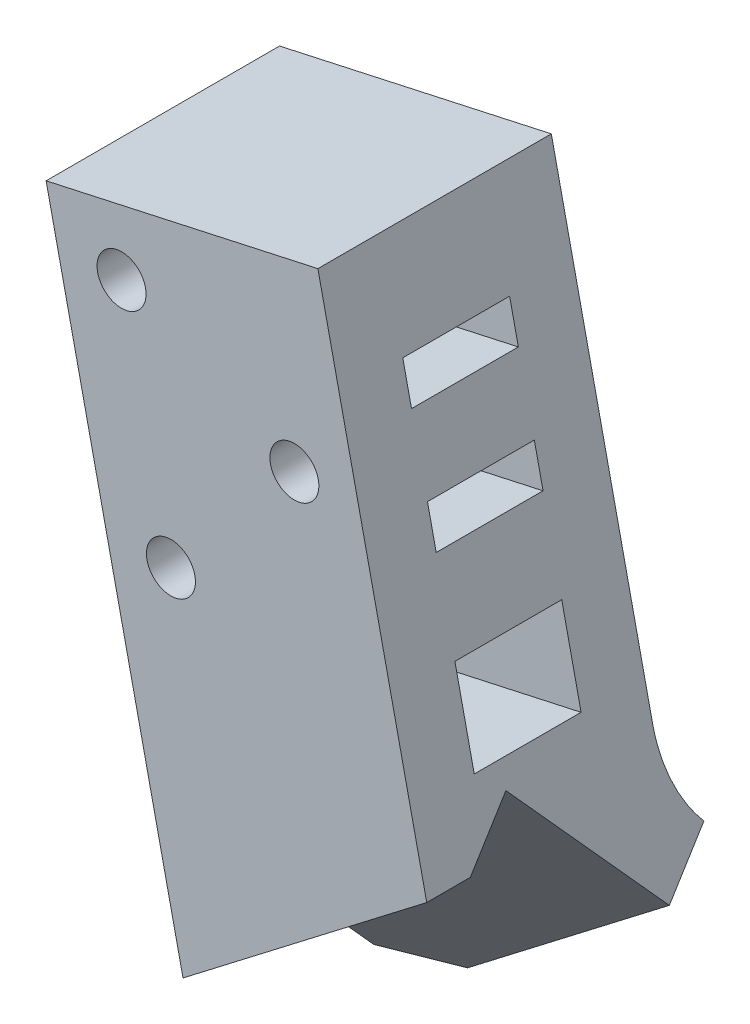
ISO-10303-21;
HEADER;
FILE_DESCRIPTION(('STEP AP214'),'2;1');
FILE_NAME('part.step','',(''),(''),'','','');
FILE_SCHEMA(('AUTOMOTIVE_DESIGN { 1 0 10303 214 1 1 1 1 }'));
ENDSEC;
DATA;
#1=APPLICATION_CONTEXT('core data for automotive mechanical design processes');
#2=APPLICATION_PROTOCOL_DEFINITION('international standard','automotive_design',2000,#1);
#3=PRODUCT_CONTEXT('',#1,'mechanical');
#4=PRODUCT('Part','Part','',(#3));
#5=PRODUCT_RELATED_PRODUCT_CATEGORY('part','',(#4));
#6=PRODUCT_DEFINITION_FORMATION('','',#4);
#7=PRODUCT_DEFINITION_CONTEXT('part definition',#1,'design');
#8=PRODUCT_DEFINITION('design','',#6,#7);
#9=PRODUCT_DEFINITION_SHAPE('','',#8);
#10=(LENGTH_UNIT() NAMED_UNIT(*) SI_UNIT(.MILLI.,.METRE.));
#11=(NAMED_UNIT(*) PLANE_ANGLE_UNIT() SI_UNIT($,.RADIAN.));
#12=(NAMED_UNIT(*) SI_UNIT($,.STERADIAN.) SOLID_ANGLE_UNIT());
#13=UNCERTAINTY_MEASURE_WITH_UNIT(LENGTH_MEASURE(1.E-05),#10,'distance_accuracy_value','');
#14=(GEOMETRIC_REPRESENTATION_CONTEXT(3) GLOBAL_UNCERTAINTY_ASSIGNED_CONTEXT((#13)) GLOBAL_UNIT_ASSIGNED_CONTEXT((#10,
#11,#12)) REPRESENTATION_CONTEXT('',''));
#15=CARTESIAN_POINT('',(0.,0.,0.));
#16=DIRECTION('',(0.,0.,1.));
#17=DIRECTION('',(1.,0.,0.));
#18=AXIS2_PLACEMENT_3D('',#15,#16,#17);
#19=CARTESIAN_POINT('',(0.,0.,-23.4188));
#20=DIRECTION('',(0.,0.,1.));
#21=DIRECTION('',(-1.,0.,0.));
#22=AXIS2_PLACEMENT_3D('',#19,#20,#21);
#23=PLANE('',#22);
#24=CARTESIAN_POINT('',(-439.229521786331,-3141.35853638833,-23.4188));
#25=DIRECTION('',(0.,0.,1.));
#26=DIRECTION('',(1.,0.,0.));
#27=AXIS2_PLACEMENT_3D('',#24,#25,#26);
#28=CIRCLE('',#27,2.45744999999997);
#29=CARTESIAN_POINT('',(-436.772071786331,-3141.35853638833,-23.4188));
#30=VERTEX_POINT('',#29);
#31=EDGE_CURVE('E326',#30,#30,#28,.T.);
#32=ORIENTED_EDGE('',*,*,#31,.T.);
#33=EDGE_LOOP('',(#32));
#34=FACE_BOUND('',#33,.T.);
#35=CARTESIAN_POINT('',(-444.184860767666,-3118.84286161487,-23.4188));
#36=DIRECTION('',(0.,0.,1.));
#37=DIRECTION('',(1.,0.,0.));
#38=AXIS2_PLACEMENT_3D('',#35,#36,#37);
#39=CIRCLE('',#38,2.45744999999997);
#40=CARTESIAN_POINT('',(-441.727410767666,-3118.84286161487,-23.4188));
#41=VERTEX_POINT('',#40);
#42=EDGE_CURVE('E334',#41,#41,#39,.T.);
#43=ORIENTED_EDGE('',*,*,#42,.T.);
#44=EDGE_LOOP('',(#43));
#45=FACE_BOUND('',#44,.T.);
#46=DIRECTION('',(0.214939998904922,-0.976627255850845,0.));
#47=VECTOR('',#46,1.);
#48=CARTESIAN_POINT('',(-451.751312835365,-3114.00614753326,-23.4188));
#49=LINE('',#48,#47);
#50=CARTESIAN_POINT('',(-451.751312835365,-3114.00614753326,-23.4188));
#51=VERTEX_POINT('',#50);
#52=CARTESIAN_POINT('',(-438.776488933921,-3172.96011946298,-23.4188));
#53=VERTEX_POINT('',#52);
#54=EDGE_CURVE('E349',#51,#53,#49,.T.);
#55=ORIENTED_EDGE('',*,*,#54,.F.);
#56=DIRECTION('',(-0.97662725585084,-0.214939998904944,0.));
#57=VECTOR('',#56,1.);
#58=CARTESIAN_POINT('',(-424.487246991543,-3108.00576381726,-23.4188));
#59=LINE('',#58,#57);
#60=CARTESIAN_POINT('',(-424.487246991543,-3108.00576381726,-23.4188));
#61=VERTEX_POINT('',#60);
#62=EDGE_CURVE('E357',#61,#51,#59,.T.);
#63=ORIENTED_EDGE('',*,*,#62,.F.);
#64=DIRECTION('',(-0.214939998904948,0.976627255850839,0.));
#65=VECTOR('',#64,1.);
#66=CARTESIAN_POINT('',(-416.376864854896,-3144.85707250977,-23.4188));
#67=LINE('',#66,#65);
#68=CARTESIAN_POINT('',(-414.325673176529,-3154.17711396447,-23.4188));
#69=VERTEX_POINT('',#68);
#70=EDGE_CURVE('E353',#69,#61,#67,.T.);
#71=ORIENTED_EDGE('',*,*,#70,.F.);
#72=CARTESIAN_POINT('',(-354.890114563021,-3108.518988063,-23.4188));
#73=CARTESIAN_POINT('',(-351.977187853561,-3112.31089635443,-23.4188));
#74=CARTESIAN_POINT('',(-349.787573346993,-3115.16123150894,-26.572351700052));
#75=CARTESIAN_POINT('',(-367.146987632977,-3117.93466222912,-23.4188));
#76=CARTESIAN_POINT('',(-364.23406092023,-3121.72657053228,-23.4188));
#77=CARTESIAN_POINT('',(-362.044446407888,-3124.57690568686,-26.5723517131039));
#78=CARTESIAN_POINT('',(-379.403860702934,-3127.35033639525,-23.4188));
#79=CARTESIAN_POINT('',(-376.490933983304,-3131.14224470736,-23.4188));
#80=CARTESIAN_POINT('',(-374.301319468782,-3133.99257986479,-26.5723517261558));
#81=CARTESIAN_POINT('',(-403.917606842847,-3146.1816847275,-23.4188));
#82=CARTESIAN_POINT('',(-401.004680109452,-3149.97359305753,-23.4188));
#83=CARTESIAN_POINT('',(-398.81506559057,-3152.82392822063,-26.5723517522596));
#84=CARTESIAN_POINT('',(-416.174479912804,-3155.59735889362,-23.4188));
#85=CARTESIAN_POINT('',(-413.261553172526,-3159.38926723261,-23.4188));
#86=CARTESIAN_POINT('',(-411.071938651464,-3162.23960239855,-26.5723517653115));
#87=CARTESIAN_POINT('',(-431.788473522686,-3167.59195779528,-23.4188));
#88=CARTESIAN_POINT('',(-428.875546770315,-3171.38386614313,-23.4188));
#89=CARTESIAN_POINT('',(-426.685932249802,-3174.23420131523,-26.5723517819383));
#90=CARTESIAN_POINT('',(-435.145594062611,-3170.17088253081,-23.4188));
#91=CARTESIAN_POINT('',(-432.232667308355,-3173.96279088111,-23.4188));
#92=CARTESIAN_POINT('',(-430.043052787245,-3176.81312605399,-26.5723517855132));
#93=CARTESIAN_POINT('',(-441.859835142462,-3175.32873200186,-23.4188));
#94=CARTESIAN_POINT('',(-438.946908384436,-3179.12064035707,-23.4188));
#95=CARTESIAN_POINT('',(-436.757293862132,-3181.97097553151,-26.5723517926629));
#96=CARTESIAN_POINT('',(-445.216955682387,-3177.90765673739,-23.4188));
#97=CARTESIAN_POINT('',(-442.304028922476,-3181.69956509506,-23.4188));
#98=CARTESIAN_POINT('',(-440.114414399575,-3184.54990027027,-26.5723517962378));
#99=CARTESIAN_POINT('',(-448.574076222313,-3180.48658147292,-23.4188));
#100=CARTESIAN_POINT('',(-445.661149460247,-3184.27848983283,-23.4188));
#101=CARTESIAN_POINT('',(-443.471534937018,-3187.12882500903,-26.5723517998127));
#102=(BOUNDED_SURFACE() B_SPLINE_SURFACE(3,2,((#72,#73,#74),(#75,#76,#77),(#78,#79,#80),(#81,
#82,#83),(#84,#85,#86),(#87,#88,#89),(#90,#91,#92),(#93,#94,#95),(#96,#97,#98),(#99,#100,#101)),
.UNSPECIFIED.,.F.,.F.,.F.) B_SPLINE_SURFACE_WITH_KNOTS((4,2,2,2,4),(3,3),(0.,46.3677982774786,
92.7355965549573,105.435596554957,118.135596554957),(0.,1.),
.UNSPECIFIED.) GEOMETRIC_REPRESENTATION_ITEM() RATIONAL_B_SPLINE_SURFACE(((1.,0.935865599997023,
1.),(1.,0.935865599722494,1.),(1.,0.935865599447958,1.),(1.,0.935865598898886,1.),(1.,
0.93586559862435,1.),(1.,0.935865598274627,1.),(1.,0.935865598199434,1.),(1.,0.935865598049047,
1.),(1.,0.935865597973853,1.),(1.,0.935865597898657,1.))) REPRESENTATION_ITEM('') SURFACE());
#103=CARTESIAN_POINT('',(-448.574076222313,-3180.48658147292,-23.4188));
#104=CARTESIAN_POINT('',(-445.216955682387,-3177.90765673739,-23.4188));
#105=CARTESIAN_POINT('',(-441.859835142462,-3175.32873200186,-23.4188));
#106=CARTESIAN_POINT('',(-435.145594062611,-3170.17088253081,-23.4188));
#107=CARTESIAN_POINT('',(-431.788473522686,-3167.59195779528,-23.4188));
#108=CARTESIAN_POINT('',(-416.174479912804,-3155.59735889362,-23.4188));
#109=CARTESIAN_POINT('',(-403.917606842847,-3146.1816847275,-23.4188));
#110=CARTESIAN_POINT('',(-379.403860702934,-3127.35033639525,-23.4188));
#111=CARTESIAN_POINT('',(-367.146987632977,-3117.93466222912,-23.4188));
#112=CARTESIAN_POINT('',(-354.890114563021,-3108.518988063,-23.4188));
#113=B_SPLINE_CURVE_WITH_KNOTS('',3,(#103,#104,#105,#106,#107,#108,#109,#110,#111,#112),
.UNSPECIFIED.,.F.,.F.,(4,2,2,2,4),(0.,12.6999999999998,25.3999999999998,71.7677982774785,
118.135596554957),.UNSPECIFIED.);
#114=EDGE_CURVE('E425',#53,#69,#113,.T.);
#115=ORIENTED_EDGE('',*,*,#114,.F.);
#116=EDGE_LOOP('',(#55,#63,#71,#115));
#117=FACE_BOUND('',#116,.T.);
#118=CARTESIAN_POINT('',(-426.846291582482,-3126.83005327169,-23.4188));
#119=DIRECTION('',(0.,0.,1.));
#120=DIRECTION('',(1.,0.,0.));
#121=AXIS2_PLACEMENT_3D('',#118,#119,#120);
#122=CIRCLE('',#121,2.45744999999997);
#123=CARTESIAN_POINT('',(-424.388841582482,-3126.83005327169,-23.4188));
#124=VERTEX_POINT('',#123);
#125=EDGE_CURVE('E342',#124,#124,#122,.T.);
#126=ORIENTED_EDGE('',*,*,#125,.T.);
#127=EDGE_LOOP('',(#126));
#128=FACE_BOUND('',#127,.T.);
#129=ADVANCED_FACE('F38',(#34,#45,#117,#128),#23,.F.);
#130=CARTESIAN_POINT('',(-430.644730128087,-3182.63466231101,-22.0997002457174));
#131=DIRECTION('',(-0.419636600196772,0.546262801685791,-0.724915219366847));
#132=DIRECTION('',(0.,-0.798635508908454,-0.601815024663339));
#133=AXIS2_PLACEMENT_3D('',#130,#131,#132);
#134=PLANE('',#133);
#135=DIRECTION('',(0.793020599570211,0.609194819952782,1.14527663349598E-09));
#136=VECTOR('',#135,1.);
#137=CARTESIAN_POINT('',(-430.644730128087,-3182.63466231101,-22.0997002457174));
#138=LINE('',#137,#136);
#139=CARTESIAN_POINT('',(-431.576719114447,-3183.35061201402,-22.0997002470634));
#140=VERTEX_POINT('',#139);
#141=CARTESIAN_POINT('',(-411.328388685993,-3167.79593662154,-22.099700212096));
#142=VERTEX_POINT('',#141);
#143=EDGE_CURVE('E374',#140,#142,#138,.T.);
#144=ORIENTED_EDGE('',*,*,#143,.T.);
#145=DIRECTION('',(-0.162934904566519,0.74033064827306,0.652198396273319));
#146=VECTOR('',#145,1.);
#147=CARTESIAN_POINT('',(-410.051263001117,-3173.59883863769,-27.2117989809774));
#148=LINE('',#147,#146);
#149=CARTESIAN_POINT('',(-414.606672451436,-3152.90033182924,-8.97733445190123));
#150=VERTEX_POINT('',#149);
#151=EDGE_CURVE('E361',#142,#150,#148,.T.);
#152=ORIENTED_EDGE('',*,*,#151,.T.);
#153=DIRECTION('',(0.793020599570211,0.609194819952782,1.14527663349598E-09));
#154=VECTOR('',#153,1.);
#155=CARTESIAN_POINT('',(-439.057488204153,-3171.68333734898,-8.97733448608995));
#156=LINE('',#155,#154);
#157=CARTESIAN_POINT('',(-439.057488201763,-3171.68333735985,-8.97733448663685));
#158=VERTEX_POINT('',#157);
#159=EDGE_CURVE('E369',#158,#150,#156,.T.);
#160=ORIENTED_EDGE('',*,*,#159,.F.);
#161=DIRECTION('',(-0.162934904586066,0.740330648362001,0.652198396167476));
#162=VECTOR('',#161,1.);
#163=CARTESIAN_POINT('',(-437.492369636639,-3178.79479849843,-15.242215680891));
#164=LINE('',#163,#162);
#165=CARTESIAN_POINT('',(-436.818938160591,-3181.85468282804,-17.9378377744077));
#166=VERTEX_POINT('',#165);
#167=EDGE_CURVE('E365',#166,#158,#164,.T.);
#168=ORIENTED_EDGE('',*,*,#167,.F.);
#169=DIRECTION('',(0.764332976711467,-0.218111452073505,-0.606813394039531));
#170=VECTOR('',#169,1.);
#171=CARTESIAN_POINT('',(-190.519660023187,-3252.13909398843,-213.477877875496));
#172=LINE('',#171,#170);
#173=EDGE_CURVE('E481',#140,#166,#172,.F.);
#174=ORIENTED_EDGE('',*,*,#173,.F.);
#175=EDGE_LOOP('',(#144,#152,#160,#168,#174));
#176=FACE_BOUND('',#175,.T.);
#177=ADVANCED_FACE('F448',(#176),#134,.F.);
#178=CARTESIAN_POINT('',(730.7193165667,-951.215358792446,-1139.78864635279));
#179=DIRECTION('',(-0.441614597168841,0.574872701419269,0.688838097618239));
#180=DIRECTION('',(0.,0.767760111423413,-0.64073739652615));
#181=AXIS2_PLACEMENT_3D('',#178,#179,#180);
#182=PLANE('',#181);
#183=DIRECTION('',(-0.793020599396075,-0.609194820179464,-8.44456975149217E-10));
#184=VECTOR('',#183,1.);
#185=CARTESIAN_POINT('',(-407.202840466047,-3159.26737875756,-26.5723517611912));
#186=LINE('',#185,#184);
#187=CARTESIAN_POINT('',(-412.337314757212,-3163.21165857186,-26.5723517666587));
#188=VERTEX_POINT('',#187);
#189=CARTESIAN_POINT('',(-432.58564519939,-3178.76633398893,-26.5723517882204));
#190=VERTEX_POINT('',#189);
#191=EDGE_CURVE('E370',#188,#190,#186,.T.);
#192=ORIENTED_EDGE('',*,*,#191,.F.);
#193=DIRECTION('',(0.155610020400141,-0.707048422725091,0.689831899431324));
#194=VECTOR('',#193,1.);
#195=CARTESIAN_POINT('',(-747.529007650292,-1640.1943287903,-1512.50443747786));
#196=LINE('',#195,#194);
#197=EDGE_CURVE('E422',#188,#142,#196,.T.);
#198=ORIENTED_EDGE('',*,*,#197,.T.);
#199=ORIENTED_EDGE('',*,*,#143,.F.);
#200=DIRECTION('',(0.155610020400117,-0.707048422725102,0.689831899431318));
#201=VECTOR('',#200,1.);
#202=CARTESIAN_POINT('',(-768.99842011186,-1650.20074884967,-1517.91759365708));
#203=LINE('',#202,#201);
#204=EDGE_CURVE('E476',#190,#140,#203,.T.);
#205=ORIENTED_EDGE('',*,*,#204,.F.);
#206=EDGE_LOOP('',(#192,#198,#199,#205));
#207=FACE_BOUND('',#206,.T.);
#208=ADVANCED_FACE('F452',(#207),#182,.F.);
#209=CARTESIAN_POINT('',(1369.31075164133,-1782.50307535105,-8.97733187412508));
#210=DIRECTION('',(0.44161459716884,-0.574872701419272,-0.68883809761824));
#211=DIRECTION('',(-0.793020599570292,-0.609194819952675,-1.14542382249495E-09));
#212=AXIS2_PLACEMENT_3D('',#209,#210,#211);
#213=PLANE('',#212);
#214=DIRECTION('',(-0.155610020400119,0.7070484227251,-0.68983189943132));
#215=VECTOR('',#214,1.);
#216=CARTESIAN_POINT('',(-419.136446570394,-3132.31830479862,-29.0581922017404));
#217=LINE('',#216,#215);
#218=CARTESIAN_POINT('',(-413.56829504717,-3157.61842841449,-4.37412281012715));
#219=VERTEX_POINT('',#218);
#220=EDGE_CURVE('E382',#219,#150,#217,.T.);
#221=ORIENTED_EDGE('',*,*,#220,.F.);
#222=DIRECTION('',(0.7930205995703,0.609194819952667,1.14542632705883E-09));
#223=VECTOR('',#222,1.);
#224=CARTESIAN_POINT('',(-438.019110846727,-3176.40143397169,-4.37412284544345));
#225=LINE('',#224,#223);
#226=CARTESIAN_POINT('',(-438.01911079961,-3176.4014339355,-4.37412284544343));
#227=VERTEX_POINT('',#226);
#228=EDGE_CURVE('E386',#227,#219,#225,.T.);
#229=ORIENTED_EDGE('',*,*,#228,.F.);
#230=DIRECTION('',(0.155610020400119,-0.7070484227251,0.68983189943132));
#231=VECTOR('',#230,1.);
#232=CARTESIAN_POINT('',(-444.660319490351,-3146.22563858695,-33.8151420926236));
#233=LINE('',#232,#231);
#234=EDGE_CURVE('E378',#158,#227,#233,.T.);
#235=ORIENTED_EDGE('',*,*,#234,.F.);
#236=ORIENTED_EDGE('',*,*,#159,.T.);
#237=EDGE_LOOP('',(#221,#229,#235,#236));
#238=FACE_BOUND('',#237,.T.);
#239=ADVANCED_FACE('F518',(#238),#213,.T.);
#240=CARTESIAN_POINT('',(-424.487246991543,-3108.00576381726,-4.3688));
#241=DIRECTION('',(0.214939998904944,-0.97662725585084,0.));
#242=DIRECTION('',(0.97662725585084,0.214939998904944,0.));
#243=AXIS2_PLACEMENT_3D('',#240,#241,#242);
#244=PLANE('',#243);
#245=DIRECTION('',(-0.97662725585084,-0.214939998904944,0.));
#246=VECTOR('',#245,1.);
#247=CARTESIAN_POINT('',(-424.487246991543,-3108.00576381726,0.));
#248=LINE('',#247,#246);
#249=CARTESIAN_POINT('',(-424.487246991543,-3108.00576381726,0.));
#250=VERTEX_POINT('',#249);
#251=CARTESIAN_POINT('',(-451.751312835365,-3114.00614753326,0.));
#252=VERTEX_POINT('',#251);
#253=EDGE_CURVE('E385',#250,#252,#248,.T.);
#254=ORIENTED_EDGE('',*,*,#253,.F.);
#255=DIRECTION('',(0.,0.,1.));
#256=VECTOR('',#255,1.);
#257=CARTESIAN_POINT('',(-424.487246991543,-3108.00576381726,-4.3688));
#258=LINE('',#257,#256);
#259=EDGE_CURVE('E406',#61,#250,#258,.T.);
#260=ORIENTED_EDGE('',*,*,#259,.F.);
#261=ORIENTED_EDGE('',*,*,#62,.T.);
#262=DIRECTION('',(0.,0.,1.));
#263=VECTOR('',#262,1.);
#264=CARTESIAN_POINT('',(-451.751312835365,-3114.00614753326,-4.3688));
#265=LINE('',#264,#263);
#266=EDGE_CURVE('E418',#51,#252,#265,.T.);
#267=ORIENTED_EDGE('',*,*,#266,.T.);
#268=EDGE_LOOP('',(#254,#260,#261,#267));
#269=FACE_BOUND('',#268,.T.);
#270=ADVANCED_FACE('F515',(#269),#244,.F.);
#271=CARTESIAN_POINT('',(-451.751312835365,-3114.00614753326,-4.3688));
#272=DIRECTION('',(0.976627255850845,0.214939998904922,0.));
#273=DIRECTION('',(-0.214939998904922,0.976627255850845,0.));
#274=AXIS2_PLACEMENT_3D('',#271,#272,#273);
#275=PLANE('',#274);
#276=DIRECTION('',(0.,0.,-1.));
#277=VECTOR('',#276,1.);
#278=CARTESIAN_POINT('',(-447.107596252733,-3135.10589725947,-4.3688));
#279=LINE('',#278,#277);
#280=CARTESIAN_POINT('',(-447.107596252733,-3135.10589725947,-6.35000000000001));
#281=VERTEX_POINT('',#280);
#282=CARTESIAN_POINT('',(-447.107596252733,-3135.10589725947,-17.0688));
#283=VERTEX_POINT('',#282);
#284=EDGE_CURVE('E318',#281,#283,#279,.T.);
#285=ORIENTED_EDGE('',*,*,#284,.F.);
#286=DIRECTION('',(-0.214939998904922,0.976627255850845,0.));
#287=VECTOR('',#286,1.);
#288=CARTESIAN_POINT('',(-451.751312835365,-3114.00614753326,-6.35000000000002));
#289=LINE('',#288,#287);
#290=CARTESIAN_POINT('',(-446.232282959902,-3139.08307611655,-6.35000000000001));
#291=VERTEX_POINT('',#290);
#292=EDGE_CURVE('E315',#291,#281,#289,.T.);
#293=ORIENTED_EDGE('',*,*,#292,.F.);
#294=DIRECTION('',(0.,0.,1.));
#295=VECTOR('',#294,1.);
#296=CARTESIAN_POINT('',(-446.232282959902,-3139.08307611655,-4.3688));
#297=LINE('',#296,#295);
#298=CARTESIAN_POINT('',(-446.232282959902,-3139.08307611655,-17.0688));
#299=VERTEX_POINT('',#298);
#300=EDGE_CURVE('E312',#299,#291,#297,.T.);
#301=ORIENTED_EDGE('',*,*,#300,.F.);
#302=DIRECTION('',(0.214939998904922,-0.976627255850845,0.));
#303=VECTOR('',#302,1.);
#304=CARTESIAN_POINT('',(-451.751312835365,-3114.00614753326,-17.0688));
#305=LINE('',#304,#303);
#306=EDGE_CURVE('E322',#283,#299,#305,.T.);
#307=ORIENTED_EDGE('',*,*,#306,.F.);
#308=EDGE_LOOP('',(#285,#293,#301,#307));
#309=FACE_BOUND('',#308,.T.);
#310=DIRECTION('',(0.,0.,-1.));
#311=VECTOR('',#310,1.);
#312=CARTESIAN_POINT('',(-444.356952963456,-3147.60405126113,-4.3688));
#313=LINE('',#312,#311);
#314=CARTESIAN_POINT('',(-444.356952963456,-3147.60405126113,-6.35));
#315=VERTEX_POINT('',#314);
#316=CARTESIAN_POINT('',(-444.356952963456,-3147.60405126113,-17.0688));
#317=VERTEX_POINT('',#316);
#318=EDGE_CURVE('E304',#315,#317,#313,.T.);
#319=ORIENTED_EDGE('',*,*,#318,.F.);
#320=DIRECTION('',(-0.214939998904922,0.976627255850845,0.));
#321=VECTOR('',#320,1.);
#322=CARTESIAN_POINT('',(-451.751312835365,-3114.00614753326,-6.35));
#323=LINE('',#322,#321);
#324=CARTESIAN_POINT('',(-442.416685892478,-3156.42008231538,-6.35));
#325=VERTEX_POINT('',#324);
#326=EDGE_CURVE('E301',#325,#315,#323,.T.);
#327=ORIENTED_EDGE('',*,*,#326,.F.);
#328=DIRECTION('',(0.,0.,1.));
#329=VECTOR('',#328,1.);
#330=CARTESIAN_POINT('',(-442.416685892478,-3156.42008231538,-4.3688));
#331=LINE('',#330,#329);
#332=CARTESIAN_POINT('',(-442.416685892478,-3156.42008231538,-17.0688));
#333=VERTEX_POINT('',#332);
#334=EDGE_CURVE('E192',#333,#325,#331,.T.);
#335=ORIENTED_EDGE('',*,*,#334,.F.);
#336=DIRECTION('',(0.214939998904922,-0.976627255850845,0.));
#337=VECTOR('',#336,1.);
#338=CARTESIAN_POINT('',(-451.751312835365,-3114.00614753326,-17.0688));
#339=LINE('',#338,#337);
#340=EDGE_CURVE('E308',#317,#333,#339,.T.);
#341=ORIENTED_EDGE('',*,*,#340,.F.);
#342=EDGE_LOOP('',(#319,#327,#335,#341));
#343=FACE_BOUND('',#342,.T.);
#344=DIRECTION('',(0.,0.,-1.));
#345=VECTOR('',#344,1.);
#346=CARTESIAN_POINT('',(-449.5852657434,-3123.84805987274,-4.3688));
#347=LINE('',#346,#345);
#348=CARTESIAN_POINT('',(-449.5852657434,-3123.84805987274,-6.35));
#349=VERTEX_POINT('',#348);
#350=CARTESIAN_POINT('',(-449.5852657434,-3123.84805987274,-17.0688));
#351=VERTEX_POINT('',#350);
#352=EDGE_CURVE('E291',#349,#351,#347,.T.);
#353=ORIENTED_EDGE('',*,*,#352,.F.);
#354=DIRECTION('',(-0.214939998904922,0.976627255850845,0.));
#355=VECTOR('',#354,1.);
#356=CARTESIAN_POINT('',(-451.751312835365,-3114.00614753326,-6.35));
#357=LINE('',#356,#355);
#358=CARTESIAN_POINT('',(-448.709952450569,-3127.82523872982,-6.35));
#359=VERTEX_POINT('',#358);
#360=EDGE_CURVE('E287',#359,#349,#357,.T.);
#361=ORIENTED_EDGE('',*,*,#360,.F.);
#362=DIRECTION('',(0.,0.,1.));
#363=VECTOR('',#362,1.);
#364=CARTESIAN_POINT('',(-448.709952450569,-3127.82523872982,-4.3688));
#365=LINE('',#364,#363);
#366=CARTESIAN_POINT('',(-448.709952450569,-3127.82523872982,-17.0688));
#367=VERTEX_POINT('',#366);
#368=EDGE_CURVE('E275',#367,#359,#365,.T.);
#369=ORIENTED_EDGE('',*,*,#368,.F.);
#370=DIRECTION('',(0.214939998904922,-0.976627255850845,0.));
#371=VECTOR('',#370,1.);
#372=CARTESIAN_POINT('',(-451.751312835365,-3114.00614753326,-17.0688));
#373=LINE('',#372,#371);
#374=EDGE_CURVE('E295',#351,#367,#373,.T.);
#375=ORIENTED_EDGE('',*,*,#374,.F.);
#376=EDGE_LOOP('',(#353,#361,#369,#375));
#377=FACE_BOUND('',#376,.T.);
#378=ORIENTED_EDGE('',*,*,#167,.T.);
#379=ORIENTED_EDGE('',*,*,#234,.T.);
#380=DIRECTION('',(0.,0.,1.));
#381=VECTOR('',#380,1.);
#382=CARTESIAN_POINT('',(-438.01911079961,-3176.4014339355,-4.3688));
#383=LINE('',#382,#381);
#384=CARTESIAN_POINT('',(-438.01911079961,-3176.4014339355,0.));
#385=VERTEX_POINT('',#384);
#386=EDGE_CURVE('E414',#227,#385,#383,.T.);
#387=ORIENTED_EDGE('',*,*,#386,.T.);
#388=DIRECTION('',(0.214939998904922,-0.976627255850845,0.));
#389=VECTOR('',#388,1.);
#390=CARTESIAN_POINT('',(-451.751312835365,-3114.00614753326,0.));
#391=LINE('',#390,#389);
#392=EDGE_CURVE('E396',#252,#385,#391,.T.);
#393=ORIENTED_EDGE('',*,*,#392,.F.);
#394=ORIENTED_EDGE('',*,*,#266,.F.);
#395=ORIENTED_EDGE('',*,*,#54,.T.);
#396=CARTESIAN_POINT('',(-436.788130528504,-3181.99466409415,-26.5723518129883));
#397=CARTESIAN_POINT('',(-436.851992492298,-3181.70449318706,-26.3362950790677));
#398=CARTESIAN_POINT('',(-436.917955252799,-3181.40477684713,-26.1126519238735));
#399=CARTESIAN_POINT('',(-437.053530397323,-3180.78876129845,-25.6910103709923));
#400=CARTESIAN_POINT('',(-437.123141371969,-3180.47246849352,-25.4930021711243));
#401=CARTESIAN_POINT('',(-437.265535271106,-3179.82547043046,-25.1232023006508));
#402=CARTESIAN_POINT('',(-437.338319279294,-3179.49476024833,-24.9514196785688));
#403=CARTESIAN_POINT('',(-437.486537499579,-3178.82129809851,-24.6346528318304));
#404=CARTESIAN_POINT('',(-437.561971956087,-3178.4785450203,-24.489671086379));
#405=CARTESIAN_POINT('',(-437.719576337211,-3177.76243478009,-24.2190529016891));
#406=CARTESIAN_POINT('',(-437.801879261574,-3177.38847330442,-24.0950921670295));
#407=CARTESIAN_POINT('',(-437.96835671157,-3176.63204632024,-23.8780480903371));
#408=CARTESIAN_POINT('',(-438.052531538042,-3176.2495794448,-23.7849697503389));
#409=CARTESIAN_POINT('',(-438.22203848367,-3175.47938727955,-23.6300762332093));
#410=CARTESIAN_POINT('',(-438.307368274334,-3175.09167256975,-23.5682056640715));
#411=CARTESIAN_POINT('',(-438.478771037156,-3174.31286634126,-23.4756387855477));
#412=CARTESIAN_POINT('',(-438.564843568979,-3173.92177682331,-23.444925134609));
#413=CARTESIAN_POINT('',(-438.671926351799,-3173.4352225995,-23.426133971586));
#414=CARTESIAN_POINT('',(-438.692843834225,-3173.34017940807,-23.4233825837996));
#415=CARTESIAN_POINT('',(-438.734669983887,-3173.15013307898,-23.4197165362034));
#416=CARTESIAN_POINT('',(-438.755578645352,-3173.05512996753,-23.4188004515642));
#417=CARTESIAN_POINT('',(-438.776488933921,-3172.96011946298,-23.4188));
#418=B_SPLINE_CURVE_WITH_KNOTS('',3,(#396,#397,#398,#399,#400,#401,#402,#403,#404,#405,#406,
#407,#408,#409,#410,#411,#412,#413,#414,#415,#416,#417),.UNSPECIFIED.,.F.,.F.,(4,2,2,2,2,2,2,2,
2,2,4),(0.,1.1379936305767,2.27555082682437,3.41349962790141,4.5515536418928,5.75767553131466,
6.96399268155308,8.16816108633693,9.37165889764143,9.66371918432326,9.95555264329704),.UNSPECIFIED.);
#419=CARTESIAN_POINT('',(-438.123350341156,-3175.92779860503,-23.7204032534594));
#420=VERTEX_POINT('',#419);
#421=EDGE_CURVE('E435',#420,#53,#418,.T.);
#422=ORIENTED_EDGE('',*,*,#421,.F.);
#423=DIRECTION('',(-0.155610020400117,0.707048422725102,-0.689831899431318));
#424=VECTOR('',#423,1.);
#425=CARTESIAN_POINT('',(-443.188907776603,-3152.91132199416,-46.1764321029357));
#426=LINE('',#425,#424);
#427=EDGE_CURVE('E53',#166,#420,#426,.T.);
#428=ORIENTED_EDGE('',*,*,#427,.F.);
#429=EDGE_LOOP('',(#378,#379,#387,#393,#394,#395,#422,#428));
#430=FACE_BOUND('',#429,.T.);
#431=ADVANCED_FACE('F493',(#309,#343,#377,#430),#275,.F.);
#432=CARTESIAN_POINT('',(-413.56829504717,-3157.61842841449,-4.3688));
#433=DIRECTION('',(-0.609194819952676,0.793020599570293,0.));
#434=DIRECTION('',(-0.793020599570293,-0.609194819952676,0.));
#435=AXIS2_PLACEMENT_3D('',#432,#433,#434);
#436=PLANE('',#435);
#437=DIRECTION('',(0.793020599570293,0.609194819952676,0.));
#438=VECTOR('',#437,1.);
#439=CARTESIAN_POINT('',(-413.56829504717,-3157.61842841449,0.));
#440=LINE('',#439,#438);
#441=CARTESIAN_POINT('',(-413.56829504717,-3157.61842841449,0.));
#442=VERTEX_POINT('',#441);
#443=EDGE_CURVE('E400',#385,#442,#440,.T.);
#444=ORIENTED_EDGE('',*,*,#443,.F.);
#445=ORIENTED_EDGE('',*,*,#386,.F.);
#446=ORIENTED_EDGE('',*,*,#228,.T.);
#447=DIRECTION('',(0.,0.,1.));
#448=VECTOR('',#447,1.);
#449=CARTESIAN_POINT('',(-413.56829504717,-3157.61842841449,-4.3688));
#450=LINE('',#449,#448);
#451=EDGE_CURVE('E410',#219,#442,#450,.T.);
#452=ORIENTED_EDGE('',*,*,#451,.T.);
#453=EDGE_LOOP('',(#444,#445,#446,#452));
#454=FACE_BOUND('',#453,.T.);
#455=ADVANCED_FACE('F508',(#454),#436,.F.);
#456=CARTESIAN_POINT('',(-413.56829504717,-3157.61842841449,-4.3688));
#457=DIRECTION('',(-0.976627255850839,-0.21493999890495,0.));
#458=DIRECTION('',(0.21493999890495,-0.976627255850839,0.));
#459=AXIS2_PLACEMENT_3D('',#456,#457,#458);
#460=PLANE('',#459);
#461=DIRECTION('',(0.,0.,1.));
#462=VECTOR('',#461,1.);
#463=CARTESIAN_POINT('',(-418.96821711608,-3133.08269240055,-17.0688));
#464=LINE('',#463,#462);
#465=CARTESIAN_POINT('',(-418.96821711608,-3133.08269240055,-17.0688));
#466=VERTEX_POINT('',#465);
#467=CARTESIAN_POINT('',(-418.96821711608,-3133.08269240055,-6.35000000000001));
#468=VERTEX_POINT('',#467);
#469=EDGE_CURVE('E232',#466,#468,#464,.T.);
#470=ORIENTED_EDGE('',*,*,#469,.T.);
#471=DIRECTION('',(-0.214939998904933,0.976627255850843,0.));
#472=VECTOR('',#471,1.);
#473=CARTESIAN_POINT('',(-418.96821711608,-3133.08269240055,-6.35000000000001));
#474=LINE('',#473,#472);
#475=CARTESIAN_POINT('',(-419.843530408911,-3129.10551354346,-6.35000000000001));
#476=VERTEX_POINT('',#475);
#477=EDGE_CURVE('E236',#468,#476,#474,.T.);
#478=ORIENTED_EDGE('',*,*,#477,.T.);
#479=DIRECTION('',(0.,0.,-1.));
#480=VECTOR('',#479,1.);
#481=CARTESIAN_POINT('',(-419.843530408911,-3129.10551354346,-17.0688));
#482=LINE('',#481,#480);
#483=CARTESIAN_POINT('',(-419.843530408911,-3129.10551354346,-17.0688));
#484=VERTEX_POINT('',#483);
#485=EDGE_CURVE('E240',#476,#484,#482,.T.);
#486=ORIENTED_EDGE('',*,*,#485,.T.);
#487=DIRECTION('',(0.214939998904933,-0.976627255850843,0.));
#488=VECTOR('',#487,1.);
#489=CARTESIAN_POINT('',(-418.96821711608,-3133.08269240055,-17.0688));
#490=LINE('',#489,#488);
#491=EDGE_CURVE('E224',#484,#466,#490,.T.);
#492=ORIENTED_EDGE('',*,*,#491,.T.);
#493=EDGE_LOOP('',(#470,#478,#486,#492));
#494=FACE_BOUND('',#493,.T.);
#495=DIRECTION('',(0.,0.,1.));
#496=VECTOR('',#495,1.);
#497=CARTESIAN_POINT('',(-415.152620048655,-3150.41969859938,-17.0688));
#498=LINE('',#497,#496);
#499=CARTESIAN_POINT('',(-415.152620048655,-3150.41969859938,-17.0688));
#500=VERTEX_POINT('',#499);
#501=CARTESIAN_POINT('',(-415.152620048655,-3150.41969859938,-6.35));
#502=VERTEX_POINT('',#501);
#503=EDGE_CURVE('E190',#500,#502,#498,.T.);
#504=ORIENTED_EDGE('',*,*,#503,.T.);
#505=DIRECTION('',(-0.214939998904948,0.976627255850839,0.));
#506=VECTOR('',#505,1.);
#507=CARTESIAN_POINT('',(-415.152620048655,-3150.41969859938,-6.35));
#508=LINE('',#507,#506);
#509=CARTESIAN_POINT('',(-417.092887119634,-3141.60366754512,-6.35));
#510=VERTEX_POINT('',#509);
#511=EDGE_CURVE('E199',#502,#510,#508,.T.);
#512=ORIENTED_EDGE('',*,*,#511,.T.);
#513=DIRECTION('',(0.,0.,-1.));
#514=VECTOR('',#513,1.);
#515=CARTESIAN_POINT('',(-417.092887119634,-3141.60366754512,-17.0688));
#516=LINE('',#515,#514);
#517=CARTESIAN_POINT('',(-417.092887119634,-3141.60366754512,-17.0688));
#518=VERTEX_POINT('',#517);
#519=EDGE_CURVE('E205',#510,#518,#516,.T.);
#520=ORIENTED_EDGE('',*,*,#519,.T.);
#521=DIRECTION('',(0.214939998904948,-0.976627255850839,0.));
#522=VECTOR('',#521,1.);
#523=CARTESIAN_POINT('',(-415.152620048655,-3150.41969859938,-17.0688));
#524=LINE('',#523,#522);
#525=EDGE_CURVE('E211',#518,#500,#524,.T.);
#526=ORIENTED_EDGE('',*,*,#525,.T.);
#527=EDGE_LOOP('',(#504,#512,#520,#526));
#528=FACE_BOUND('',#527,.T.);
#529=DIRECTION('',(0.,0.,1.));
#530=VECTOR('',#529,1.);
#531=CARTESIAN_POINT('',(-421.445886606748,-3121.82485501382,-17.0688));
#532=LINE('',#531,#530);
#533=CARTESIAN_POINT('',(-421.445886606747,-3121.82485501382,-17.0688));
#534=VERTEX_POINT('',#533);
#535=CARTESIAN_POINT('',(-421.445886606748,-3121.82485501382,-6.35));
#536=VERTEX_POINT('',#535);
#537=EDGE_CURVE('E259',#534,#536,#532,.T.);
#538=ORIENTED_EDGE('',*,*,#537,.T.);
#539=DIRECTION('',(-0.214939998904959,0.976627255850837,0.));
#540=VECTOR('',#539,1.);
#541=CARTESIAN_POINT('',(-421.445886606748,-3121.82485501382,-6.35));
#542=LINE('',#541,#540);
#543=CARTESIAN_POINT('',(-422.321199899578,-3117.84767615673,-6.35));
#544=VERTEX_POINT('',#543);
#545=EDGE_CURVE('E263',#536,#544,#542,.T.);
#546=ORIENTED_EDGE('',*,*,#545,.T.);
#547=DIRECTION('',(0.,0.,-1.));
#548=VECTOR('',#547,1.);
#549=CARTESIAN_POINT('',(-422.321199899578,-3117.84767615673,-17.0688));
#550=LINE('',#549,#548);
#551=CARTESIAN_POINT('',(-422.321199899578,-3117.84767615673,-17.0688));
#552=VERTEX_POINT('',#551);
#553=EDGE_CURVE('E267',#544,#552,#550,.T.);
#554=ORIENTED_EDGE('',*,*,#553,.T.);
#555=DIRECTION('',(0.214939998904959,-0.976627255850837,0.));
#556=VECTOR('',#555,1.);
#557=CARTESIAN_POINT('',(-421.445886606748,-3121.82485501382,-17.0688));
#558=LINE('',#557,#556);
#559=EDGE_CURVE('E248',#552,#534,#558,.T.);
#560=ORIENTED_EDGE('',*,*,#559,.T.);
#561=EDGE_LOOP('',(#538,#546,#554,#560));
#562=FACE_BOUND('',#561,.T.);
#563=ORIENTED_EDGE('',*,*,#70,.T.);
#564=ORIENTED_EDGE('',*,*,#259,.T.);
#565=DIRECTION('',(-0.21493999890495,0.976627255850839,0.));
#566=VECTOR('',#565,1.);
#567=CARTESIAN_POINT('',(-413.56829504717,-3157.61842841449,0.));
#568=LINE('',#567,#566);
#569=EDGE_CURVE('E403',#442,#250,#568,.T.);
#570=ORIENTED_EDGE('',*,*,#569,.F.);
#571=ORIENTED_EDGE('',*,*,#451,.F.);
#572=ORIENTED_EDGE('',*,*,#220,.T.);
#573=ORIENTED_EDGE('',*,*,#151,.F.);
#574=ORIENTED_EDGE('',*,*,#197,.F.);
#575=CARTESIAN_POINT('',(-414.325673176529,-3154.17711396447,-23.4188));
#576=CARTESIAN_POINT('',(-414.243345869296,-3154.55118622908,-23.4187900429517));
#577=CARTESIAN_POINT('',(-414.161016945508,-3154.92526583886,-23.4330050444125));
#578=CARTESIAN_POINT('',(-413.996783730586,-3155.67149564637,-23.4898247725242));
#579=CARTESIAN_POINT('',(-413.914879600854,-3156.04364511073,-23.5324395923215));
#580=CARTESIAN_POINT('',(-413.753995211553,-3156.77465879098,-23.6445959422224));
#581=CARTESIAN_POINT('',(-413.674992706799,-3157.13362408276,-23.7134462410312));
#582=CARTESIAN_POINT('',(-413.518315956836,-3157.84551942636,-23.8779212823007));
#583=CARTESIAN_POINT('',(-413.440641268725,-3158.19845149058,-23.973536904528));
#584=CARTESIAN_POINT('',(-413.2724037,-3158.96287596212,-24.2121038503544));
#585=CARTESIAN_POINT('',(-413.182200838109,-3159.37273254501,-24.36060034373));
#586=CARTESIAN_POINT('',(-413.005031607907,-3160.17773998893,-24.6947638737652));
#587=CARTESIAN_POINT('',(-412.918065347353,-3160.57289036033,-24.8804321466803));
#588=CARTESIAN_POINT('',(-412.745610971816,-3161.35647482296,-25.2943726704896));
#589=CARTESIAN_POINT('',(-412.660245688878,-3161.74435079973,-25.523756963193));
#590=CARTESIAN_POINT('',(-412.494668818301,-3162.49668580283,-26.0201462351888));
#591=CARTESIAN_POINT('',(-412.414459992966,-3162.86113227804,-26.2871711379492));
#592=CARTESIAN_POINT('',(-412.337314775096,-3163.21165857754,-26.5723517610553));
#593=B_SPLINE_CURVE_WITH_KNOTS('',3,(#575,#576,#577,#578,#579,#580,#581,#582,#583,#584,#585,
#586,#587,#588,#589,#590,#591,#592),.UNSPECIFIED.,.F.,.F.,(4,2,2,2,2,2,2,2,4),(0.,
1.14882360941487,2.29805572259678,3.41889615481322,4.53935512670875,5.87301886770368,
7.20672697092492,8.58048972786714,9.95498237774388),.UNSPECIFIED.);
#594=EDGE_CURVE('E482',#69,#188,#593,.T.);
#595=ORIENTED_EDGE('',*,*,#594,.F.);
#596=EDGE_LOOP('',(#563,#564,#570,#571,#572,#573,#574,#595));
#597=FACE_BOUND('',#596,.T.);
#598=ADVANCED_FACE('F208',(#494,#528,#562,#597),#460,.F.);
#599=CARTESIAN_POINT('',(0.,0.,0.));
#600=DIRECTION('',(0.,0.,-1.));
#601=DIRECTION('',(1.,0.,0.));
#602=AXIS2_PLACEMENT_3D('',#599,#600,#601);
#603=PLANE('',#602);
#604=CARTESIAN_POINT('',(-439.229521786331,-3141.35853638833,0.));
#605=DIRECTION('',(0.,0.,1.));
#606=DIRECTION('',(1.,0.,0.));
#607=AXIS2_PLACEMENT_3D('',#604,#605,#606);
#608=CIRCLE('',#607,2.45744999999997);
#609=CARTESIAN_POINT('',(-436.772071786331,-3141.35853638833,0.));
#610=VERTEX_POINT('',#609);
#611=EDGE_CURVE('E330',#610,#610,#608,.T.);
#612=ORIENTED_EDGE('',*,*,#611,.F.);
#613=EDGE_LOOP('',(#612));
#614=FACE_BOUND('',#613,.T.);
#615=CARTESIAN_POINT('',(-444.184860767666,-3118.84286161487,0.));
#616=DIRECTION('',(0.,0.,1.));
#617=DIRECTION('',(1.,0.,0.));
#618=AXIS2_PLACEMENT_3D('',#615,#616,#617);
#619=CIRCLE('',#618,2.45744999999997);
#620=CARTESIAN_POINT('',(-441.727410767666,-3118.84286161487,0.));
#621=VERTEX_POINT('',#620);
#622=EDGE_CURVE('E338',#621,#621,#619,.T.);
#623=ORIENTED_EDGE('',*,*,#622,.F.);
#624=EDGE_LOOP('',(#623));
#625=FACE_BOUND('',#624,.T.);
#626=CARTESIAN_POINT('',(-426.846291582482,-3126.83005327169,0.));
#627=DIRECTION('',(0.,0.,1.));
#628=DIRECTION('',(1.,0.,0.));
#629=AXIS2_PLACEMENT_3D('',#626,#627,#628);
#630=CIRCLE('',#629,2.45744999999997);
#631=CARTESIAN_POINT('',(-424.388841582482,-3126.83005327169,0.));
#632=VERTEX_POINT('',#631);
#633=EDGE_CURVE('E346',#632,#632,#630,.T.);
#634=ORIENTED_EDGE('',*,*,#633,.F.);
#635=EDGE_LOOP('',(#634));
#636=FACE_BOUND('',#635,.T.);
#637=ORIENTED_EDGE('',*,*,#253,.T.);
#638=ORIENTED_EDGE('',*,*,#392,.T.);
#639=ORIENTED_EDGE('',*,*,#443,.T.);
#640=ORIENTED_EDGE('',*,*,#569,.T.);
#641=EDGE_LOOP('',(#637,#638,#639,#640));
#642=FACE_BOUND('',#641,.T.);
#643=ADVANCED_FACE('F461',(#614,#625,#636,#642),#603,.F.);
#644=ORIENTED_EDGE('',*,*,#421,.T.);
#645=ORIENTED_EDGE('',*,*,#114,.T.);
#646=ORIENTED_EDGE('',*,*,#594,.T.);
#647=ORIENTED_EDGE('',*,*,#191,.T.);
#648=CARTESIAN_POINT('',(-438.123350341156,-3175.92779860503,-23.7204032534594));
#649=CARTESIAN_POINT('',(-437.81771455459,-3176.14756343864,-23.8003529499606));
#650=CARTESIAN_POINT('',(-437.509231929531,-3176.3575665679,-23.8955421231844));
#651=CARTESIAN_POINT('',(-436.889371681909,-3176.75721591864,-24.1142203097416));
#652=CARTESIAN_POINT('',(-436.577995827248,-3176.94687378387,-24.2376930079668));
#653=CARTESIAN_POINT('',(-435.960929000794,-3177.30172339911,-24.5081651939942));
#654=CARTESIAN_POINT('',(-435.655246886607,-3177.46732354776,-24.6546532512679));
#655=CARTESIAN_POINT('',(-435.045541487099,-3177.7781036039,-24.9707965279028));
#656=CARTESIAN_POINT('',(-434.741517955868,-3177.92328662224,-25.1404482101748));
#657=CARTESIAN_POINT('',(-434.283136552764,-3178.1278923177,-25.4137744164133));
#658=CARTESIAN_POINT('',(-434.127447494928,-3178.19485553749,-25.5097162968568));
#659=CARTESIAN_POINT('',(-433.817261172862,-3178.32329628525,-25.7069699306039));
#660=CARTESIAN_POINT('',(-433.662763615963,-3178.38477520226,-25.8082803137797));
#661=CARTESIAN_POINT('',(-433.353540074464,-3178.50288447829,-26.0171138876157));
#662=CARTESIAN_POINT('',(-433.198828626347,-3178.55945734994,-26.1246910096926));
#663=CARTESIAN_POINT('',(-432.890989859024,-3178.66705552233,-26.3448421772695));
#664=CARTESIAN_POINT('',(-432.737862855951,-3178.71807973459,-26.4574171971307));
#665=CARTESIAN_POINT('',(-432.58564519939,-3178.76633398893,-26.5723517882208));
#666=B_SPLINE_CURVE_WITH_KNOTS('',3,(#648,#649,#650,#651,#652,#653,#654,#655,#656,#657,#658,
#659,#660,#661,#662,#663,#664,#665),.UNSPECIFIED.,.F.,.F.,(4,2,2,2,2,2,2,2,4),(0.,
1.15387844142872,2.30709294670724,3.43758773489046,4.56791008900852,5.15203585946367,
5.73601326302541,6.32610334826843,6.91630898359898),.UNSPECIFIED.);
#667=EDGE_CURVE('E11',#420,#190,#666,.T.);
#668=ORIENTED_EDGE('',*,*,#667,.F.);
#669=EDGE_LOOP('',(#644,#645,#646,#647,#668));
#670=FACE_BOUND('',#669,.T.);
#671=ADVANCED_FACE('F456',(#670),#102,.F.);
#672=CARTESIAN_POINT('',(-768.998420111867,-1650.20074884967,-1517.91759365708));
#673=DIRECTION('',(0.585735287923897,0.6283694750839,0.51192379829765));
#674=DIRECTION('',(0.155610020400117,-0.707048422725102,0.689831899431318));
#675=AXIS2_PLACEMENT_3D('',#672,#673,#674);
#676=PLANE('',#675);
#677=ORIENTED_EDGE('',*,*,#667,.T.);
#678=ORIENTED_EDGE('',*,*,#204,.T.);
#679=ORIENTED_EDGE('',*,*,#173,.T.);
#680=ORIENTED_EDGE('',*,*,#427,.T.);
#681=EDGE_LOOP('',(#677,#678,#679,#680));
#682=FACE_BOUND('',#681,.T.);
#683=ADVANCED_FACE('F40',(#682),#676,.F.);
#684=CARTESIAN_POINT('',(-426.846291582482,-3126.83005327169,-23.4188));
#685=DIRECTION('',(0.,0.,-1.));
#686=DIRECTION('',(1.,0.,0.));
#687=AXIS2_PLACEMENT_3D('',#684,#685,#686);
#688=CYLINDRICAL_SURFACE('',#687,2.45744999999997);
#689=ORIENTED_EDGE('',*,*,#633,.T.);
#690=EDGE_LOOP('',(#689));
#691=FACE_BOUND('',#690,.T.);
#692=ORIENTED_EDGE('',*,*,#125,.F.);
#693=EDGE_LOOP('',(#692));
#694=FACE_BOUND('',#693,.T.);
#695=ADVANCED_FACE('F450',(#691,#694),#688,.F.);
#696=CARTESIAN_POINT('',(-444.184860767666,-3118.84286161487,-23.4188));
#697=DIRECTION('',(0.,0.,-1.));
#698=DIRECTION('',(1.,0.,0.));
#699=AXIS2_PLACEMENT_3D('',#696,#697,#698);
#700=CYLINDRICAL_SURFACE('',#699,2.45744999999997);
#701=ORIENTED_EDGE('',*,*,#622,.T.);
#702=EDGE_LOOP('',(#701));
#703=FACE_BOUND('',#702,.T.);
#704=ORIENTED_EDGE('',*,*,#42,.F.);
#705=EDGE_LOOP('',(#704));
#706=FACE_BOUND('',#705,.T.);
#707=ADVANCED_FACE('F534',(#703,#706),#700,.F.);
#708=CARTESIAN_POINT('',(-439.229521786331,-3141.35853638833,-23.4188));
#709=DIRECTION('',(0.,0.,-1.));
#710=DIRECTION('',(1.,0.,0.));
#711=AXIS2_PLACEMENT_3D('',#708,#709,#710);
#712=CYLINDRICAL_SURFACE('',#711,2.45744999999997);
#713=ORIENTED_EDGE('',*,*,#611,.T.);
#714=EDGE_LOOP('',(#713));
#715=FACE_BOUND('',#714,.T.);
#716=ORIENTED_EDGE('',*,*,#31,.F.);
#717=EDGE_LOOP('',(#716));
#718=FACE_BOUND('',#717,.T.);
#719=ADVANCED_FACE('F540',(#715,#718),#712,.F.);
#720=CARTESIAN_POINT('',(-463.266483176438,-3131.02889773026,-17.0688));
#721=DIRECTION('',(0.,0.,-1.));
#722=DIRECTION('',(1.,0.,0.));
#723=AXIS2_PLACEMENT_3D('',#720,#721,#722);
#724=PLANE('',#723);
#725=DIRECTION('',(0.976627255850839,0.21493999890495,0.));
#726=VECTOR('',#725,1.);
#727=CARTESIAN_POINT('',(-464.141796469269,-3127.05171887317,-17.0688));
#728=LINE('',#727,#726);
#729=EDGE_CURVE('E272',#351,#552,#728,.T.);
#730=ORIENTED_EDGE('',*,*,#729,.F.);
#731=ORIENTED_EDGE('',*,*,#374,.T.);
#732=DIRECTION('',(0.976627255850839,0.21493999890495,0.));
#733=VECTOR('',#732,1.);
#734=CARTESIAN_POINT('',(-463.266483176438,-3131.02889773026,-17.0688));
#735=LINE('',#734,#733);
#736=EDGE_CURVE('E271',#367,#534,#735,.T.);
#737=ORIENTED_EDGE('',*,*,#736,.T.);
#738=ORIENTED_EDGE('',*,*,#559,.F.);
#739=EDGE_LOOP('',(#730,#731,#737,#738));
#740=FACE_BOUND('',#739,.T.);
#741=ADVANCED_FACE('F557',(#740),#724,.F.);
#742=CARTESIAN_POINT('',(-464.141796469269,-3127.05171887317,-17.0688));
#743=DIRECTION('',(-0.21493999890495,0.976627255850839,0.));
#744=DIRECTION('',(-0.976627255850839,-0.21493999890495,0.));
#745=AXIS2_PLACEMENT_3D('',#742,#743,#744);
#746=PLANE('',#745);
#747=DIRECTION('',(0.976627255850839,0.21493999890495,0.));
#748=VECTOR('',#747,1.);
#749=CARTESIAN_POINT('',(-464.141796469269,-3127.05171887317,-6.35));
#750=LINE('',#749,#748);
#751=EDGE_CURVE('E276',#349,#544,#750,.T.);
#752=ORIENTED_EDGE('',*,*,#751,.F.);
#753=ORIENTED_EDGE('',*,*,#352,.T.);
#754=ORIENTED_EDGE('',*,*,#729,.T.);
#755=ORIENTED_EDGE('',*,*,#553,.F.);
#756=EDGE_LOOP('',(#752,#753,#754,#755));
#757=FACE_BOUND('',#756,.T.);
#758=ADVANCED_FACE('F563',(#757),#746,.F.);
#759=CARTESIAN_POINT('',(-463.266483176438,-3131.02889773026,-6.35));
#760=DIRECTION('',(0.,0.,1.));
#761=DIRECTION('',(-1.,0.,0.));
#762=AXIS2_PLACEMENT_3D('',#759,#760,#761);
#763=PLANE('',#762);
#764=DIRECTION('',(0.976627255850839,0.21493999890495,0.));
#765=VECTOR('',#764,1.);
#766=CARTESIAN_POINT('',(-463.266483176438,-3131.02889773026,-6.35));
#767=LINE('',#766,#765);
#768=EDGE_CURVE('E279',#359,#536,#767,.T.);
#769=ORIENTED_EDGE('',*,*,#768,.F.);
#770=ORIENTED_EDGE('',*,*,#360,.T.);
#771=ORIENTED_EDGE('',*,*,#751,.T.);
#772=ORIENTED_EDGE('',*,*,#545,.F.);
#773=EDGE_LOOP('',(#769,#770,#771,#772));
#774=FACE_BOUND('',#773,.T.);
#775=ADVANCED_FACE('F571',(#774),#763,.F.);
#776=CARTESIAN_POINT('',(-463.266483176438,-3131.02889773026,-17.0688));
#777=DIRECTION('',(0.21493999890495,-0.976627255850839,0.));
#778=DIRECTION('',(0.976627255850839,0.21493999890495,0.));
#779=AXIS2_PLACEMENT_3D('',#776,#777,#778);
#780=PLANE('',#779);
#781=ORIENTED_EDGE('',*,*,#736,.F.);
#782=ORIENTED_EDGE('',*,*,#368,.T.);
#783=ORIENTED_EDGE('',*,*,#768,.T.);
#784=ORIENTED_EDGE('',*,*,#537,.F.);
#785=EDGE_LOOP('',(#781,#782,#783,#784));
#786=FACE_BOUND('',#785,.T.);
#787=ADVANCED_FACE('F567',(#786),#780,.F.);
#788=CARTESIAN_POINT('',(-456.973216618346,-3159.62374131582,-17.0688));
#789=DIRECTION('',(0.,0.,-1.));
#790=DIRECTION('',(1.,0.,0.));
#791=AXIS2_PLACEMENT_3D('',#788,#789,#790);
#792=PLANE('',#791);
#793=DIRECTION('',(0.976627255850839,0.21493999890495,0.));
#794=VECTOR('',#793,1.);
#795=CARTESIAN_POINT('',(-458.913483689324,-3150.80771026156,-17.0688));
#796=LINE('',#795,#794);
#797=EDGE_CURVE('E221',#317,#518,#796,.T.);
#798=ORIENTED_EDGE('',*,*,#797,.F.);
#799=ORIENTED_EDGE('',*,*,#340,.T.);
#800=DIRECTION('',(0.976627255850839,0.21493999890495,0.));
#801=VECTOR('',#800,1.);
#802=CARTESIAN_POINT('',(-456.973216618346,-3159.62374131582,-17.0688));
#803=LINE('',#802,#801);
#804=EDGE_CURVE('E196',#333,#500,#803,.T.);
#805=ORIENTED_EDGE('',*,*,#804,.T.);
#806=ORIENTED_EDGE('',*,*,#525,.F.);
#807=EDGE_LOOP('',(#798,#799,#805,#806));
#808=FACE_BOUND('',#807,.T.);
#809=ADVANCED_FACE('F570',(#808),#792,.F.);
#810=CARTESIAN_POINT('',(-458.913483689324,-3150.80771026156,-17.0688));
#811=DIRECTION('',(-0.21493999890495,0.976627255850839,0.));
#812=DIRECTION('',(-0.976627255850839,-0.21493999890495,0.));
#813=AXIS2_PLACEMENT_3D('',#810,#811,#812);
#814=PLANE('',#813);
#815=DIRECTION('',(0.976627255850839,0.21493999890495,0.));
#816=VECTOR('',#815,1.);
#817=CARTESIAN_POINT('',(-458.913483689324,-3150.80771026156,-6.35));
#818=LINE('',#817,#816);
#819=EDGE_CURVE('E195',#315,#510,#818,.T.);
#820=ORIENTED_EDGE('',*,*,#819,.F.);
#821=ORIENTED_EDGE('',*,*,#318,.T.);
#822=ORIENTED_EDGE('',*,*,#797,.T.);
#823=ORIENTED_EDGE('',*,*,#519,.F.);
#824=EDGE_LOOP('',(#820,#821,#822,#823));
#825=FACE_BOUND('',#824,.T.);
#826=ADVANCED_FACE('F596',(#825),#814,.F.);
#827=CARTESIAN_POINT('',(-456.973216618346,-3159.62374131582,-6.35));
#828=DIRECTION('',(0.,0.,1.));
#829=DIRECTION('',(-1.,0.,0.));
#830=AXIS2_PLACEMENT_3D('',#827,#828,#829);
#831=PLANE('',#830);
#832=DIRECTION('',(0.976627255850839,0.21493999890495,0.));
#833=VECTOR('',#832,1.);
#834=CARTESIAN_POINT('',(-456.973216618346,-3159.62374131582,-6.35));
#835=LINE('',#834,#833);
#836=EDGE_CURVE('E68',#325,#502,#835,.T.);
#837=ORIENTED_EDGE('',*,*,#836,.F.);
#838=ORIENTED_EDGE('',*,*,#326,.T.);
#839=ORIENTED_EDGE('',*,*,#819,.T.);
#840=ORIENTED_EDGE('',*,*,#511,.F.);
#841=EDGE_LOOP('',(#837,#838,#839,#840));
#842=FACE_BOUND('',#841,.T.);
#843=ADVANCED_FACE('F200',(#842),#831,.F.);
#844=CARTESIAN_POINT('',(-456.973216618346,-3159.62374131582,-17.0688));
#845=DIRECTION('',(0.21493999890495,-0.976627255850839,0.));
#846=DIRECTION('',(0.976627255850839,0.21493999890495,0.));
#847=AXIS2_PLACEMENT_3D('',#844,#845,#846);
#848=PLANE('',#847);
#849=ORIENTED_EDGE('',*,*,#804,.F.);
#850=ORIENTED_EDGE('',*,*,#334,.T.);
#851=ORIENTED_EDGE('',*,*,#836,.T.);
#852=ORIENTED_EDGE('',*,*,#503,.F.);
#853=EDGE_LOOP('',(#849,#850,#851,#852));
#854=FACE_BOUND('',#853,.T.);
#855=ADVANCED_FACE('F188',(#854),#848,.F.);
#856=CARTESIAN_POINT('',(-460.78881368577,-3142.28673511699,-17.0688));
#857=DIRECTION('',(0.,0.,-1.));
#858=DIRECTION('',(1.,0.,0.));
#859=AXIS2_PLACEMENT_3D('',#856,#857,#858);
#860=PLANE('',#859);
#861=DIRECTION('',(0.976627255850839,0.21493999890495,0.));
#862=VECTOR('',#861,1.);
#863=CARTESIAN_POINT('',(-461.664126978601,-3138.3095562599,-17.0688));
#864=LINE('',#863,#862);
#865=EDGE_CURVE('E245',#283,#484,#864,.T.);
#866=ORIENTED_EDGE('',*,*,#865,.F.);
#867=ORIENTED_EDGE('',*,*,#306,.T.);
#868=DIRECTION('',(0.976627255850839,0.21493999890495,0.));
#869=VECTOR('',#868,1.);
#870=CARTESIAN_POINT('',(-460.78881368577,-3142.28673511699,-17.0688));
#871=LINE('',#870,#869);
#872=EDGE_CURVE('E244',#299,#466,#871,.T.);
#873=ORIENTED_EDGE('',*,*,#872,.T.);
#874=ORIENTED_EDGE('',*,*,#491,.F.);
#875=EDGE_LOOP('',(#866,#867,#873,#874));
#876=FACE_BOUND('',#875,.T.);
#877=ADVANCED_FACE('F579',(#876),#860,.F.);
#878=CARTESIAN_POINT('',(-461.664126978601,-3138.3095562599,-17.0688));
#879=DIRECTION('',(-0.21493999890495,0.976627255850839,0.));
#880=DIRECTION('',(-0.976627255850839,-0.21493999890495,0.));
#881=AXIS2_PLACEMENT_3D('',#878,#879,#880);
#882=PLANE('',#881);
#883=DIRECTION('',(0.976627255850839,0.21493999890495,0.));
#884=VECTOR('',#883,1.);
#885=CARTESIAN_POINT('',(-461.664126978601,-3138.3095562599,-6.35000000000001));
#886=LINE('',#885,#884);
#887=EDGE_CURVE('E249',#281,#476,#886,.T.);
#888=ORIENTED_EDGE('',*,*,#887,.F.);
#889=ORIENTED_EDGE('',*,*,#284,.T.);
#890=ORIENTED_EDGE('',*,*,#865,.T.);
#891=ORIENTED_EDGE('',*,*,#485,.F.);
#892=EDGE_LOOP('',(#888,#889,#890,#891));
#893=FACE_BOUND('',#892,.T.);
#894=ADVANCED_FACE('F582',(#893),#882,.F.);
#895=CARTESIAN_POINT('',(-460.78881368577,-3142.28673511699,-6.35000000000001));
#896=DIRECTION('',(0.,0.,1.));
#897=DIRECTION('',(0.,1.,0.));
#898=AXIS2_PLACEMENT_3D('',#895,#896,#897);
#899=PLANE('',#898);
#900=DIRECTION('',(0.976627255850839,0.21493999890495,0.));
#901=VECTOR('',#900,1.);
#902=CARTESIAN_POINT('',(-460.78881368577,-3142.28673511699,-6.35000000000001));
#903=LINE('',#902,#901);
#904=EDGE_CURVE('E60',#291,#468,#903,.T.);
#905=ORIENTED_EDGE('',*,*,#904,.F.);
#906=ORIENTED_EDGE('',*,*,#292,.T.);
#907=ORIENTED_EDGE('',*,*,#887,.T.);
#908=ORIENTED_EDGE('',*,*,#477,.F.);
#909=EDGE_LOOP('',(#905,#906,#907,#908));
#910=FACE_BOUND('',#909,.T.);
#911=ADVANCED_FACE('F587',(#910),#899,.F.);
#912=CARTESIAN_POINT('',(-460.78881368577,-3142.28673511699,-17.0688));
#913=DIRECTION('',(0.21493999890495,-0.976627255850839,0.));
#914=DIRECTION('',(0.976627255850839,0.21493999890495,0.));
#915=AXIS2_PLACEMENT_3D('',#912,#913,#914);
#916=PLANE('',#915);
#917=ORIENTED_EDGE('',*,*,#872,.F.);
#918=ORIENTED_EDGE('',*,*,#300,.T.);
#919=ORIENTED_EDGE('',*,*,#904,.T.);
#920=ORIENTED_EDGE('',*,*,#469,.F.);
#921=EDGE_LOOP('',(#917,#918,#919,#920));
#922=FACE_BOUND('',#921,.T.);
#923=ADVANCED_FACE('F584',(#922),#916,.F.);
#924=CLOSED_SHELL('',(#129,#177,#208,#239,#270,#431,#455,#598,#643,#671,#683,#695,#707,#719,
#741,#758,#775,#787,#809,#826,#843,#855,#877,#894,#911,#923));
#925=MANIFOLD_SOLID_BREP('B2',#924);
#926=ADVANCED_BREP_SHAPE_REPRESENTATION('',(#18,#925),#14);
#927=SHAPE_DEFINITION_REPRESENTATION(#9,#926);
ENDSEC;
END-ISO-10303-21;
